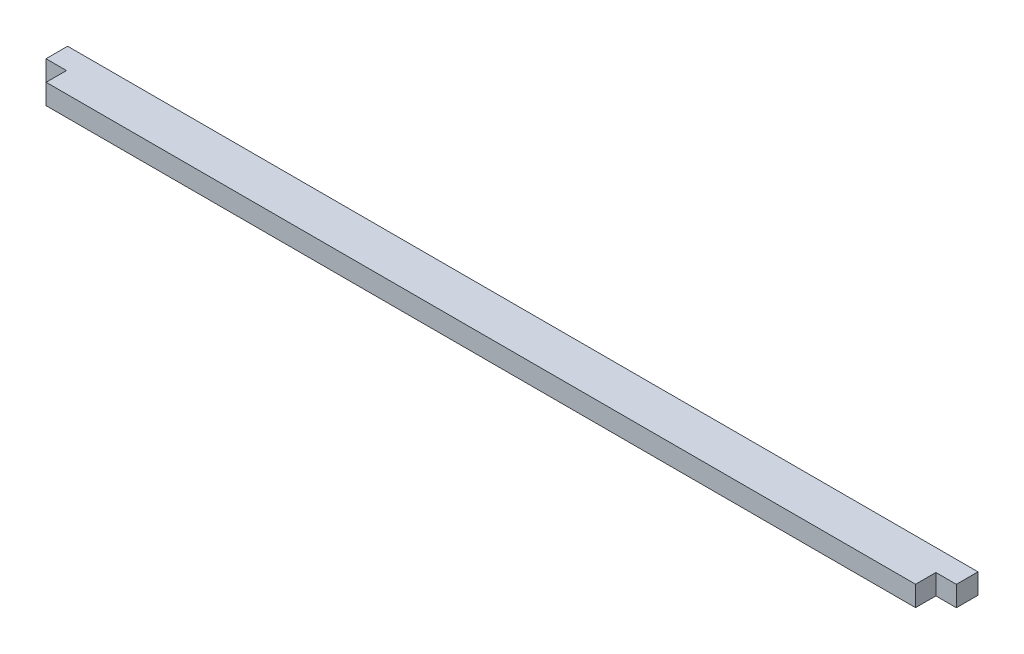
ISO-10303-21;
HEADER;
FILE_DESCRIPTION(('STEP AP214'),'2;1');
FILE_NAME('part.step','',(''),(''),'','','');
FILE_SCHEMA(('AUTOMOTIVE_DESIGN { 1 0 10303 214 1 1 1 1 }'));
ENDSEC;
DATA;
#1=APPLICATION_CONTEXT('core data for automotive mechanical design processes');
#2=APPLICATION_PROTOCOL_DEFINITION('international standard','automotive_design',2000,#1);
#3=PRODUCT_CONTEXT('',#1,'mechanical');
#4=PRODUCT('Part','Part','',(#3));
#5=PRODUCT_RELATED_PRODUCT_CATEGORY('part','',(#4));
#6=PRODUCT_DEFINITION_FORMATION('','',#4);
#7=PRODUCT_DEFINITION_CONTEXT('part definition',#1,'design');
#8=PRODUCT_DEFINITION('design','',#6,#7);
#9=PRODUCT_DEFINITION_SHAPE('','',#8);
#10=(LENGTH_UNIT() NAMED_UNIT(*) SI_UNIT(.MILLI.,.METRE.));
#11=(NAMED_UNIT(*) PLANE_ANGLE_UNIT() SI_UNIT($,.RADIAN.));
#12=(NAMED_UNIT(*) SI_UNIT($,.STERADIAN.) SOLID_ANGLE_UNIT());
#13=UNCERTAINTY_MEASURE_WITH_UNIT(LENGTH_MEASURE(1.E-05),#10,'distance_accuracy_value','');
#14=(GEOMETRIC_REPRESENTATION_CONTEXT(3) GLOBAL_UNCERTAINTY_ASSIGNED_CONTEXT((#13)) GLOBAL_UNIT_ASSIGNED_CONTEXT((#10,
#11,#12)) REPRESENTATION_CONTEXT('',''));
#15=CARTESIAN_POINT('',(0.,0.,0.));
#16=DIRECTION('',(0.,0.,1.));
#17=DIRECTION('',(1.,0.,0.));
#18=AXIS2_PLACEMENT_3D('',#15,#16,#17);
#19=CARTESIAN_POINT('',(138.89355,0.,3.2766));
#20=DIRECTION('',(0.,0.,1.));
#21=DIRECTION('',(1.,0.,0.));
#22=AXIS2_PLACEMENT_3D('',#19,#20,#21);
#23=PLANE('',#22);
#24=DIRECTION('',(1.,0.,0.));
#25=VECTOR('',#24,1.);
#26=CARTESIAN_POINT('',(138.89355,3.175,3.2766));
#27=LINE('',#26,#25);
#28=CARTESIAN_POINT('',(138.89355,3.175,3.2766));
#29=VERTEX_POINT('',#28);
#30=CARTESIAN_POINT('',(142.09395,3.175,3.2766));
#31=VERTEX_POINT('',#30);
#32=EDGE_CURVE('E171',#29,#31,#27,.T.);
#33=ORIENTED_EDGE('',*,*,#32,.F.);
#34=DIRECTION('',(0.,1.,0.));
#35=VECTOR('',#34,1.);
#36=CARTESIAN_POINT('',(138.89355,0.,3.2766));
#37=LINE('',#36,#35);
#38=CARTESIAN_POINT('',(138.89355,0.,3.2766));
#39=VERTEX_POINT('',#38);
#40=EDGE_CURVE('E12',#39,#29,#37,.T.);
#41=ORIENTED_EDGE('',*,*,#40,.F.);
#42=DIRECTION('',(1.,0.,0.));
#43=VECTOR('',#42,1.);
#44=CARTESIAN_POINT('',(138.89355,0.,3.2766));
#45=LINE('',#44,#43);
#46=CARTESIAN_POINT('',(142.09395,0.,3.2766));
#47=VERTEX_POINT('',#46);
#48=EDGE_CURVE('E163',#39,#47,#45,.T.);
#49=ORIENTED_EDGE('',*,*,#48,.T.);
#50=DIRECTION('',(0.,1.,0.));
#51=VECTOR('',#50,1.);
#52=CARTESIAN_POINT('',(142.09395,0.,3.2766));
#53=LINE('',#52,#51);
#54=EDGE_CURVE('E46',#47,#31,#53,.T.);
#55=ORIENTED_EDGE('',*,*,#54,.T.);
#56=EDGE_LOOP('',(#33,#41,#49,#55));
#57=FACE_BOUND('',#56,.T.);
#58=ADVANCED_FACE('F42',(#57),#23,.T.);
#59=CARTESIAN_POINT('',(138.89355,0.,6.4516));
#60=DIRECTION('',(1.,0.,0.));
#61=DIRECTION('',(0.,0.,-1.));
#62=AXIS2_PLACEMENT_3D('',#59,#60,#61);
#63=PLANE('',#62);
#64=DIRECTION('',(0.,0.,-1.));
#65=VECTOR('',#64,1.);
#66=CARTESIAN_POINT('',(138.89355,3.175,6.4516));
#67=LINE('',#66,#65);
#68=CARTESIAN_POINT('',(138.89355,3.175,6.4516));
#69=VERTEX_POINT('',#68);
#70=EDGE_CURVE('E166',#69,#29,#67,.T.);
#71=ORIENTED_EDGE('',*,*,#70,.F.);
#72=DIRECTION('',(0.,1.,0.));
#73=VECTOR('',#72,1.);
#74=CARTESIAN_POINT('',(138.89355,0.,6.4516));
#75=LINE('',#74,#73);
#76=CARTESIAN_POINT('',(138.89355,0.,6.4516));
#77=VERTEX_POINT('',#76);
#78=EDGE_CURVE('E53',#77,#69,#75,.T.);
#79=ORIENTED_EDGE('',*,*,#78,.F.);
#80=DIRECTION('',(0.,0.,-1.));
#81=VECTOR('',#80,1.);
#82=CARTESIAN_POINT('',(138.89355,0.,6.4516));
#83=LINE('',#82,#81);
#84=EDGE_CURVE('E131',#77,#39,#83,.T.);
#85=ORIENTED_EDGE('',*,*,#84,.T.);
#86=ORIENTED_EDGE('',*,*,#40,.T.);
#87=EDGE_LOOP('',(#71,#79,#85,#86));
#88=FACE_BOUND('',#87,.T.);
#89=ADVANCED_FACE('F215',(#88),#63,.T.);
#90=CARTESIAN_POINT('',(3.09880000000001,0.,6.4516));
#91=DIRECTION('',(0.,0.,1.));
#92=DIRECTION('',(1.,0.,0.));
#93=AXIS2_PLACEMENT_3D('',#90,#91,#92);
#94=PLANE('',#93);
#95=DIRECTION('',(1.,0.,0.));
#96=VECTOR('',#95,1.);
#97=CARTESIAN_POINT('',(3.09880000000001,3.175,6.4516));
#98=LINE('',#97,#96);
#99=CARTESIAN_POINT('',(3.09880000000001,3.175,6.4516));
#100=VERTEX_POINT('',#99);
#101=EDGE_CURVE('E118',#100,#69,#98,.T.);
#102=ORIENTED_EDGE('',*,*,#101,.F.);
#103=DIRECTION('',(0.,1.,0.));
#104=VECTOR('',#103,1.);
#105=CARTESIAN_POINT('',(3.09880000000001,0.,6.4516));
#106=LINE('',#105,#104);
#107=CARTESIAN_POINT('',(3.09880000000001,0.,6.4516));
#108=VERTEX_POINT('',#107);
#109=EDGE_CURVE('E113',#108,#100,#106,.T.);
#110=ORIENTED_EDGE('',*,*,#109,.F.);
#111=DIRECTION('',(1.,0.,0.));
#112=VECTOR('',#111,1.);
#113=CARTESIAN_POINT('',(3.09880000000001,0.,6.4516));
#114=LINE('',#113,#112);
#115=EDGE_CURVE('E116',#108,#77,#114,.T.);
#116=ORIENTED_EDGE('',*,*,#115,.T.);
#117=ORIENTED_EDGE('',*,*,#78,.T.);
#118=EDGE_LOOP('',(#102,#110,#116,#117));
#119=FACE_BOUND('',#118,.T.);
#120=ADVANCED_FACE('F115',(#119),#94,.T.);
#121=CARTESIAN_POINT('',(3.09880000000001,0.,3.27660000000001));
#122=DIRECTION('',(-1.,0.,0.));
#123=DIRECTION('',(0.,0.,1.));
#124=AXIS2_PLACEMENT_3D('',#121,#122,#123);
#125=PLANE('',#124);
#126=DIRECTION('',(0.,0.,1.));
#127=VECTOR('',#126,1.);
#128=CARTESIAN_POINT('',(3.09880000000001,3.175,3.27660000000001));
#129=LINE('',#128,#127);
#130=CARTESIAN_POINT('',(3.09880000000001,3.175,3.27660000000001));
#131=VERTEX_POINT('',#130);
#132=EDGE_CURVE('E191',#131,#100,#129,.T.);
#133=ORIENTED_EDGE('',*,*,#132,.F.);
#134=DIRECTION('',(0.,1.,0.));
#135=VECTOR('',#134,1.);
#136=CARTESIAN_POINT('',(3.09880000000001,0.,3.27660000000001));
#137=LINE('',#136,#135);
#138=CARTESIAN_POINT('',(3.09880000000001,0.,3.27660000000001));
#139=VERTEX_POINT('',#138);
#140=EDGE_CURVE('E124',#139,#131,#137,.T.);
#141=ORIENTED_EDGE('',*,*,#140,.F.);
#142=DIRECTION('',(0.,0.,1.));
#143=VECTOR('',#142,1.);
#144=CARTESIAN_POINT('',(3.09880000000001,0.,3.27660000000001));
#145=LINE('',#144,#143);
#146=EDGE_CURVE('E129',#139,#108,#145,.T.);
#147=ORIENTED_EDGE('',*,*,#146,.T.);
#148=ORIENTED_EDGE('',*,*,#109,.T.);
#149=EDGE_LOOP('',(#133,#141,#147,#148));
#150=FACE_BOUND('',#149,.T.);
#151=ADVANCED_FACE('F134',(#150),#125,.T.);
#152=CARTESIAN_POINT('',(-0.1016,0.,3.27660000000001));
#153=DIRECTION('',(0.,0.,1.));
#154=DIRECTION('',(1.,0.,0.));
#155=AXIS2_PLACEMENT_3D('',#152,#153,#154);
#156=PLANE('',#155);
#157=DIRECTION('',(1.,0.,0.));
#158=VECTOR('',#157,1.);
#159=CARTESIAN_POINT('',(-0.1016,3.175,3.27660000000001));
#160=LINE('',#159,#158);
#161=CARTESIAN_POINT('',(-0.1016,3.175,3.27660000000001));
#162=VERTEX_POINT('',#161);
#163=EDGE_CURVE('E187',#162,#131,#160,.T.);
#164=ORIENTED_EDGE('',*,*,#163,.F.);
#165=DIRECTION('',(0.,1.,0.));
#166=VECTOR('',#165,1.);
#167=CARTESIAN_POINT('',(-0.1016,0.,3.27660000000001));
#168=LINE('',#167,#166);
#169=CARTESIAN_POINT('',(-0.1016,0.,3.27660000000001));
#170=VERTEX_POINT('',#169);
#171=EDGE_CURVE('E203',#170,#162,#168,.T.);
#172=ORIENTED_EDGE('',*,*,#171,.F.);
#173=DIRECTION('',(1.,0.,0.));
#174=VECTOR('',#173,1.);
#175=CARTESIAN_POINT('',(-0.1016,0.,3.27660000000001));
#176=LINE('',#175,#174);
#177=EDGE_CURVE('E136',#170,#139,#176,.T.);
#178=ORIENTED_EDGE('',*,*,#177,.T.);
#179=ORIENTED_EDGE('',*,*,#140,.T.);
#180=EDGE_LOOP('',(#164,#172,#178,#179));
#181=FACE_BOUND('',#180,.T.);
#182=ADVANCED_FACE('F227',(#181),#156,.T.);
#183=CARTESIAN_POINT('',(-0.1016,0.,-0.1016));
#184=DIRECTION('',(-1.,0.,0.));
#185=DIRECTION('',(0.,0.,1.));
#186=AXIS2_PLACEMENT_3D('',#183,#184,#185);
#187=PLANE('',#186);
#188=DIRECTION('',(0.,0.,1.));
#189=VECTOR('',#188,1.);
#190=CARTESIAN_POINT('',(-0.1016,3.175,-0.1016));
#191=LINE('',#190,#189);
#192=CARTESIAN_POINT('',(-0.1016,3.175,-0.1016));
#193=VERTEX_POINT('',#192);
#194=EDGE_CURVE('E183',#193,#162,#191,.T.);
#195=ORIENTED_EDGE('',*,*,#194,.F.);
#196=DIRECTION('',(0.,1.,0.));
#197=VECTOR('',#196,1.);
#198=CARTESIAN_POINT('',(-0.1016,0.,-0.1016));
#199=LINE('',#198,#197);
#200=CARTESIAN_POINT('',(-0.1016,0.,-0.1016));
#201=VERTEX_POINT('',#200);
#202=EDGE_CURVE('E206',#201,#193,#199,.T.);
#203=ORIENTED_EDGE('',*,*,#202,.F.);
#204=DIRECTION('',(0.,0.,1.));
#205=VECTOR('',#204,1.);
#206=CARTESIAN_POINT('',(-0.1016,0.,-0.1016));
#207=LINE('',#206,#205);
#208=EDGE_CURVE('E139',#201,#170,#207,.T.);
#209=ORIENTED_EDGE('',*,*,#208,.T.);
#210=ORIENTED_EDGE('',*,*,#171,.T.);
#211=EDGE_LOOP('',(#195,#203,#209,#210));
#212=FACE_BOUND('',#211,.T.);
#213=ADVANCED_FACE('F230',(#212),#187,.T.);
#214=CARTESIAN_POINT('',(142.09395,0.,-0.1016));
#215=DIRECTION('',(0.,0.,-1.));
#216=DIRECTION('',(-1.,0.,0.));
#217=AXIS2_PLACEMENT_3D('',#214,#215,#216);
#218=PLANE('',#217);
#219=DIRECTION('',(-1.,0.,0.));
#220=VECTOR('',#219,1.);
#221=CARTESIAN_POINT('',(142.09395,3.175,-0.1016));
#222=LINE('',#221,#220);
#223=CARTESIAN_POINT('',(142.09395,3.175,-0.1016));
#224=VERTEX_POINT('',#223);
#225=EDGE_CURVE('E179',#224,#193,#222,.T.);
#226=ORIENTED_EDGE('',*,*,#225,.F.);
#227=DIRECTION('',(0.,1.,0.));
#228=VECTOR('',#227,1.);
#229=CARTESIAN_POINT('',(142.09395,0.,-0.1016));
#230=LINE('',#229,#228);
#231=CARTESIAN_POINT('',(142.09395,0.,-0.1016));
#232=VERTEX_POINT('',#231);
#233=EDGE_CURVE('E208',#232,#224,#230,.T.);
#234=ORIENTED_EDGE('',*,*,#233,.F.);
#235=DIRECTION('',(-1.,0.,0.));
#236=VECTOR('',#235,1.);
#237=CARTESIAN_POINT('',(142.09395,0.,-0.1016));
#238=LINE('',#237,#236);
#239=EDGE_CURVE('E155',#232,#201,#238,.T.);
#240=ORIENTED_EDGE('',*,*,#239,.T.);
#241=ORIENTED_EDGE('',*,*,#202,.T.);
#242=EDGE_LOOP('',(#226,#234,#240,#241));
#243=FACE_BOUND('',#242,.T.);
#244=ADVANCED_FACE('F234',(#243),#218,.T.);
#245=CARTESIAN_POINT('',(142.09395,0.,3.2766));
#246=DIRECTION('',(1.,0.,0.));
#247=DIRECTION('',(0.,0.,-1.));
#248=AXIS2_PLACEMENT_3D('',#245,#246,#247);
#249=PLANE('',#248);
#250=DIRECTION('',(0.,0.,-1.));
#251=VECTOR('',#250,1.);
#252=CARTESIAN_POINT('',(142.09395,3.175,3.2766));
#253=LINE('',#252,#251);
#254=EDGE_CURVE('E175',#31,#224,#253,.T.);
#255=ORIENTED_EDGE('',*,*,#254,.F.);
#256=ORIENTED_EDGE('',*,*,#54,.F.);
#257=DIRECTION('',(0.,0.,-1.));
#258=VECTOR('',#257,1.);
#259=CARTESIAN_POINT('',(142.09395,0.,3.2766));
#260=LINE('',#259,#258);
#261=EDGE_CURVE('E159',#47,#232,#260,.T.);
#262=ORIENTED_EDGE('',*,*,#261,.T.);
#263=ORIENTED_EDGE('',*,*,#233,.T.);
#264=EDGE_LOOP('',(#255,#256,#262,#263));
#265=FACE_BOUND('',#264,.T.);
#266=ADVANCED_FACE('F212',(#265),#249,.T.);
#267=CARTESIAN_POINT('',(0.,3.175,0.));
#268=DIRECTION('',(0.,-1.,0.));
#269=DIRECTION('',(0.,0.,-1.));
#270=AXIS2_PLACEMENT_3D('',#267,#268,#269);
#271=PLANE('',#270);
#272=ORIENTED_EDGE('',*,*,#32,.T.);
#273=ORIENTED_EDGE('',*,*,#254,.T.);
#274=ORIENTED_EDGE('',*,*,#225,.T.);
#275=ORIENTED_EDGE('',*,*,#194,.T.);
#276=ORIENTED_EDGE('',*,*,#163,.T.);
#277=ORIENTED_EDGE('',*,*,#132,.T.);
#278=ORIENTED_EDGE('',*,*,#101,.T.);
#279=ORIENTED_EDGE('',*,*,#70,.T.);
#280=EDGE_LOOP('',(#272,#273,#274,#275,#276,#277,#278,#279));
#281=FACE_BOUND('',#280,.T.);
#282=ADVANCED_FACE('F214',(#281),#271,.F.);
#283=CARTESIAN_POINT('',(0.,0.,0.));
#284=DIRECTION('',(0.,-1.,0.));
#285=DIRECTION('',(0.,0.,-1.));
#286=AXIS2_PLACEMENT_3D('',#283,#284,#285);
#287=PLANE('',#286);
#288=ORIENTED_EDGE('',*,*,#48,.F.);
#289=ORIENTED_EDGE('',*,*,#84,.F.);
#290=ORIENTED_EDGE('',*,*,#115,.F.);
#291=ORIENTED_EDGE('',*,*,#146,.F.);
#292=ORIENTED_EDGE('',*,*,#177,.F.);
#293=ORIENTED_EDGE('',*,*,#208,.F.);
#294=ORIENTED_EDGE('',*,*,#239,.F.);
#295=ORIENTED_EDGE('',*,*,#261,.F.);
#296=EDGE_LOOP('',(#288,#289,#290,#291,#292,#293,#294,#295));
#297=FACE_BOUND('',#296,.T.);
#298=ADVANCED_FACE('F44',(#297),#287,.T.);
#299=CLOSED_SHELL('',(#58,#89,#120,#151,#182,#213,#244,#266,#282,#298));
#300=MANIFOLD_SOLID_BREP('B2',#299);
#301=ADVANCED_BREP_SHAPE_REPRESENTATION('',(#18,#300),#14);
#302=SHAPE_DEFINITION_REPRESENTATION(#9,#301);
ENDSEC;
END-ISO-10303-21;
